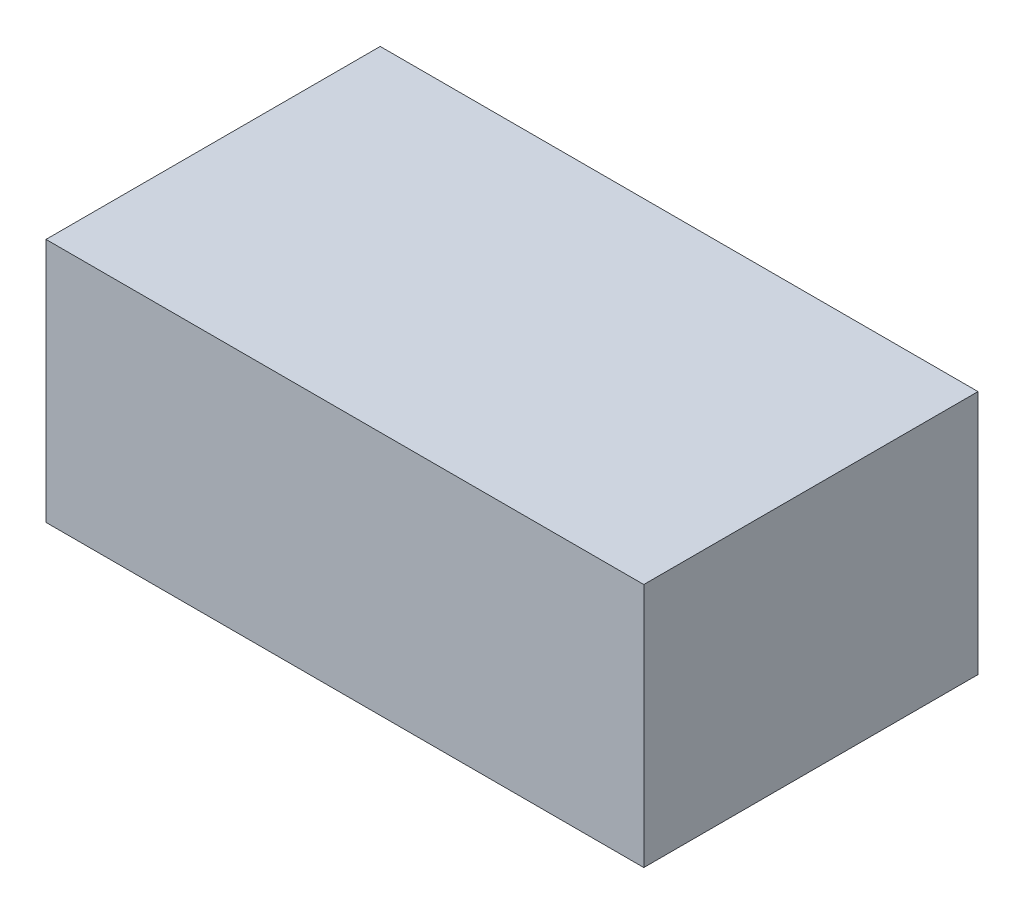
ISO-10303-21;
HEADER;
FILE_DESCRIPTION(('STEP AP214'),'2;1');
FILE_NAME('part.step','',(''),(''),'','','');
FILE_SCHEMA(('AUTOMOTIVE_DESIGN { 1 0 10303 214 1 1 1 1 }'));
ENDSEC;
DATA;
#1=APPLICATION_CONTEXT('core data for automotive mechanical design processes');
#2=APPLICATION_PROTOCOL_DEFINITION('international standard','automotive_design',2000,#1);
#3=PRODUCT_CONTEXT('',#1,'mechanical');
#4=PRODUCT('Part','Part','',(#3));
#5=PRODUCT_RELATED_PRODUCT_CATEGORY('part','',(#4));
#6=PRODUCT_DEFINITION_FORMATION('','',#4);
#7=PRODUCT_DEFINITION_CONTEXT('part definition',#1,'design');
#8=PRODUCT_DEFINITION('design','',#6,#7);
#9=PRODUCT_DEFINITION_SHAPE('','',#8);
#10=(LENGTH_UNIT() NAMED_UNIT(*) SI_UNIT(.MILLI.,.METRE.));
#11=(NAMED_UNIT(*) PLANE_ANGLE_UNIT() SI_UNIT($,.RADIAN.));
#12=(NAMED_UNIT(*) SI_UNIT($,.STERADIAN.) SOLID_ANGLE_UNIT());
#13=UNCERTAINTY_MEASURE_WITH_UNIT(LENGTH_MEASURE(1.E-05),#10,'distance_accuracy_value','');
#14=(GEOMETRIC_REPRESENTATION_CONTEXT(3) GLOBAL_UNCERTAINTY_ASSIGNED_CONTEXT((#13)) GLOBAL_UNIT_ASSIGNED_CONTEXT((#10,
#11,#12)) REPRESENTATION_CONTEXT('',''));
#15=CARTESIAN_POINT('',(0.,0.,0.));
#16=DIRECTION('',(0.,0.,1.));
#17=DIRECTION('',(1.,0.,0.));
#18=AXIS2_PLACEMENT_3D('',#15,#16,#17);
#19=CARTESIAN_POINT('',(14.4018,11.811,-8.0518));
#20=DIRECTION('',(-1.,0.,0.));
#21=DIRECTION('',(0.,0.,1.));
#22=AXIS2_PLACEMENT_3D('',#19,#20,#21);
#23=PLANE('',#22);
#24=DIRECTION('',(0.,0.,-1.));
#25=VECTOR('',#24,1.);
#26=CARTESIAN_POINT('',(14.4018,0.,-8.0518));
#27=LINE('',#26,#25);
#28=CARTESIAN_POINT('',(14.4018,0.,8.0518));
#29=VERTEX_POINT('',#28);
#30=CARTESIAN_POINT('',(14.4018,0.,-8.0518));
#31=VERTEX_POINT('',#30);
#32=EDGE_CURVE('E107',#29,#31,#27,.T.);
#33=ORIENTED_EDGE('',*,*,#32,.T.);
#34=DIRECTION('',(0.,-1.,0.));
#35=VECTOR('',#34,1.);
#36=CARTESIAN_POINT('',(14.4018,11.811,-8.0518));
#37=LINE('',#36,#35);
#38=CARTESIAN_POINT('',(14.4018,11.811,-8.0518));
#39=VERTEX_POINT('',#38);
#40=EDGE_CURVE('E11',#39,#31,#37,.T.);
#41=ORIENTED_EDGE('',*,*,#40,.F.);
#42=DIRECTION('',(0.,0.,-1.));
#43=VECTOR('',#42,1.);
#44=CARTESIAN_POINT('',(14.4018,11.811,-8.0518));
#45=LINE('',#44,#43);
#46=CARTESIAN_POINT('',(14.4018,11.811,8.0518));
#47=VERTEX_POINT('',#46);
#48=EDGE_CURVE('E91',#47,#39,#45,.T.);
#49=ORIENTED_EDGE('',*,*,#48,.F.);
#50=DIRECTION('',(0.,-1.,0.));
#51=VECTOR('',#50,1.);
#52=CARTESIAN_POINT('',(14.4018,11.811,8.0518));
#53=LINE('',#52,#51);
#54=EDGE_CURVE('E103',#47,#29,#53,.T.);
#55=ORIENTED_EDGE('',*,*,#54,.T.);
#56=EDGE_LOOP('',(#33,#41,#49,#55));
#57=FACE_BOUND('',#56,.T.);
#58=ADVANCED_FACE('F39',(#57),#23,.F.);
#59=CARTESIAN_POINT('',(-14.4018,11.811,-8.0518));
#60=DIRECTION('',(0.,0.,1.));
#61=DIRECTION('',(1.,0.,0.));
#62=AXIS2_PLACEMENT_3D('',#59,#60,#61);
#63=PLANE('',#62);
#64=DIRECTION('',(-1.,0.,0.));
#65=VECTOR('',#64,1.);
#66=CARTESIAN_POINT('',(-14.4018,0.,-8.0518));
#67=LINE('',#66,#65);
#68=CARTESIAN_POINT('',(-14.4018,0.,-8.0518));
#69=VERTEX_POINT('',#68);
#70=EDGE_CURVE('E96',#31,#69,#67,.T.);
#71=ORIENTED_EDGE('',*,*,#70,.T.);
#72=DIRECTION('',(0.,-1.,0.));
#73=VECTOR('',#72,1.);
#74=CARTESIAN_POINT('',(-14.4018,11.811,-8.0518));
#75=LINE('',#74,#73);
#76=CARTESIAN_POINT('',(-14.4018,11.811,-8.0518));
#77=VERTEX_POINT('',#76);
#78=EDGE_CURVE('E48',#77,#69,#75,.T.);
#79=ORIENTED_EDGE('',*,*,#78,.F.);
#80=DIRECTION('',(-1.,0.,0.));
#81=VECTOR('',#80,1.);
#82=CARTESIAN_POINT('',(-14.4018,11.811,-8.0518));
#83=LINE('',#82,#81);
#84=EDGE_CURVE('E86',#39,#77,#83,.T.);
#85=ORIENTED_EDGE('',*,*,#84,.F.);
#86=ORIENTED_EDGE('',*,*,#40,.T.);
#87=EDGE_LOOP('',(#71,#79,#85,#86));
#88=FACE_BOUND('',#87,.T.);
#89=ADVANCED_FACE('F95',(#88),#63,.F.);
#90=CARTESIAN_POINT('',(-14.4018,11.811,-8.0518));
#91=DIRECTION('',(1.,0.,0.));
#92=DIRECTION('',(0.,0.,-1.));
#93=AXIS2_PLACEMENT_3D('',#90,#91,#92);
#94=PLANE('',#93);
#95=DIRECTION('',(0.,0.,1.));
#96=VECTOR('',#95,1.);
#97=CARTESIAN_POINT('',(-14.4018,0.,-8.0518));
#98=LINE('',#97,#96);
#99=CARTESIAN_POINT('',(-14.4018,0.,8.0518));
#100=VERTEX_POINT('',#99);
#101=EDGE_CURVE('E73',#69,#100,#98,.T.);
#102=ORIENTED_EDGE('',*,*,#101,.T.);
#103=DIRECTION('',(0.,-1.,0.));
#104=VECTOR('',#103,1.);
#105=CARTESIAN_POINT('',(-14.4018,11.811,8.0518));
#106=LINE('',#105,#104);
#107=CARTESIAN_POINT('',(-14.4018,11.811,8.0518));
#108=VERTEX_POINT('',#107);
#109=EDGE_CURVE('E98',#108,#100,#106,.T.);
#110=ORIENTED_EDGE('',*,*,#109,.F.);
#111=DIRECTION('',(0.,0.,1.));
#112=VECTOR('',#111,1.);
#113=CARTESIAN_POINT('',(-14.4018,11.811,-8.0518));
#114=LINE('',#113,#112);
#115=EDGE_CURVE('E89',#77,#108,#114,.T.);
#116=ORIENTED_EDGE('',*,*,#115,.F.);
#117=ORIENTED_EDGE('',*,*,#78,.T.);
#118=EDGE_LOOP('',(#102,#110,#116,#117));
#119=FACE_BOUND('',#118,.T.);
#120=ADVANCED_FACE('F99',(#119),#94,.F.);
#121=CARTESIAN_POINT('',(-14.4018,11.811,8.0518));
#122=DIRECTION('',(0.,0.,-1.));
#123=DIRECTION('',(-1.,0.,0.));
#124=AXIS2_PLACEMENT_3D('',#121,#122,#123);
#125=PLANE('',#124);
#126=DIRECTION('',(1.,0.,0.));
#127=VECTOR('',#126,1.);
#128=CARTESIAN_POINT('',(-14.4018,0.,8.0518));
#129=LINE('',#128,#127);
#130=EDGE_CURVE('E79',#100,#29,#129,.T.);
#131=ORIENTED_EDGE('',*,*,#130,.T.);
#132=ORIENTED_EDGE('',*,*,#54,.F.);
#133=DIRECTION('',(1.,0.,0.));
#134=VECTOR('',#133,1.);
#135=CARTESIAN_POINT('',(-14.4018,11.811,8.0518));
#136=LINE('',#135,#134);
#137=EDGE_CURVE('E56',#108,#47,#136,.T.);
#138=ORIENTED_EDGE('',*,*,#137,.F.);
#139=ORIENTED_EDGE('',*,*,#109,.T.);
#140=EDGE_LOOP('',(#131,#132,#138,#139));
#141=FACE_BOUND('',#140,.T.);
#142=ADVANCED_FACE('F120',(#141),#125,.F.);
#143=CARTESIAN_POINT('',(0.,11.811,0.));
#144=DIRECTION('',(0.,1.,0.));
#145=DIRECTION('',(0.,0.,1.));
#146=AXIS2_PLACEMENT_3D('',#143,#144,#145);
#147=PLANE('',#146);
#148=ORIENTED_EDGE('',*,*,#48,.T.);
#149=ORIENTED_EDGE('',*,*,#84,.T.);
#150=ORIENTED_EDGE('',*,*,#115,.T.);
#151=ORIENTED_EDGE('',*,*,#137,.T.);
#152=EDGE_LOOP('',(#148,#149,#150,#151));
#153=FACE_BOUND('',#152,.T.);
#154=ADVANCED_FACE('F87',(#153),#147,.T.);
#155=CARTESIAN_POINT('',(0.,0.,0.));
#156=DIRECTION('',(0.,1.,0.));
#157=DIRECTION('',(0.,0.,1.));
#158=AXIS2_PLACEMENT_3D('',#155,#156,#157);
#159=PLANE('',#158);
#160=ORIENTED_EDGE('',*,*,#32,.F.);
#161=ORIENTED_EDGE('',*,*,#130,.F.);
#162=ORIENTED_EDGE('',*,*,#101,.F.);
#163=ORIENTED_EDGE('',*,*,#70,.F.);
#164=EDGE_LOOP('',(#160,#161,#162,#163));
#165=FACE_BOUND('',#164,.T.);
#166=ADVANCED_FACE('F123',(#165),#159,.F.);
#167=CLOSED_SHELL('',(#58,#89,#120,#142,#154,#166));
#168=MANIFOLD_SOLID_BREP('B2',#167);
#169=ADVANCED_BREP_SHAPE_REPRESENTATION('',(#18,#168),#14);
#170=SHAPE_DEFINITION_REPRESENTATION(#9,#169);
ENDSEC;
END-ISO-10303-21;
